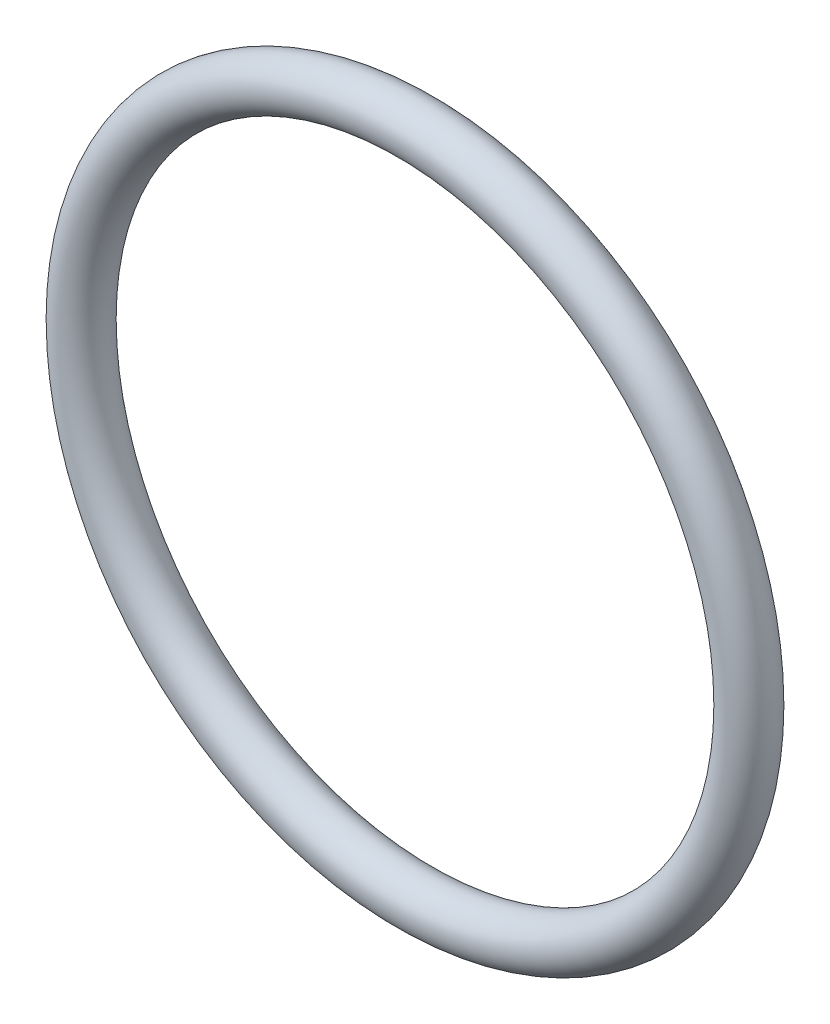
ISO-10303-21;
HEADER;
FILE_DESCRIPTION(('STEP AP214'),'2;1');
FILE_NAME('part.step','',(''),(''),'','','');
FILE_SCHEMA(('AUTOMOTIVE_DESIGN { 1 0 10303 214 1 1 1 1 }'));
ENDSEC;
DATA;
#1=APPLICATION_CONTEXT('core data for automotive mechanical design processes');
#2=APPLICATION_PROTOCOL_DEFINITION('international standard','automotive_design',2000,#1);
#3=PRODUCT_CONTEXT('',#1,'mechanical');
#4=PRODUCT('Part','Part','',(#3));
#5=PRODUCT_RELATED_PRODUCT_CATEGORY('part','',(#4));
#6=PRODUCT_DEFINITION_FORMATION('','',#4);
#7=PRODUCT_DEFINITION_CONTEXT('part definition',#1,'design');
#8=PRODUCT_DEFINITION('design','',#6,#7);
#9=PRODUCT_DEFINITION_SHAPE('','',#8);
#10=(LENGTH_UNIT() NAMED_UNIT(*) SI_UNIT(.MILLI.,.METRE.));
#11=(NAMED_UNIT(*) PLANE_ANGLE_UNIT() SI_UNIT($,.RADIAN.));
#12=(NAMED_UNIT(*) SI_UNIT($,.STERADIAN.) SOLID_ANGLE_UNIT());
#13=UNCERTAINTY_MEASURE_WITH_UNIT(LENGTH_MEASURE(1.E-05),#10,'distance_accuracy_value','');
#14=(GEOMETRIC_REPRESENTATION_CONTEXT(3) GLOBAL_UNCERTAINTY_ASSIGNED_CONTEXT((#13)) GLOBAL_UNIT_ASSIGNED_CONTEXT((#10,
#11,#12)) REPRESENTATION_CONTEXT('',''));
#15=CARTESIAN_POINT('',(0.,0.,0.));
#16=DIRECTION('',(0.,0.,1.));
#17=DIRECTION('',(1.,0.,0.));
#18=AXIS2_PLACEMENT_3D('',#15,#16,#17);
#19=CARTESIAN_POINT('',(0.,0.,0.));
#20=DIRECTION('',(0.,0.,1.));
#21=DIRECTION('',(1.,0.,0.));
#22=AXIS2_PLACEMENT_3D('',#19,#20,#21);
#23=TOROIDAL_SURFACE('',#22,23.7871,1.76530000000001);
#24=CARTESIAN_POINT('',(25.5524,0.,0.));
#25=VERTEX_POINT('',#24);
#26=VERTEX_LOOP('',#25);
#27=FACE_BOUND('',#26,.T.);
#28=ADVANCED_FACE('F30',(#27),#23,.T.);
#29=CLOSED_SHELL('',(#28));
#30=MANIFOLD_SOLID_BREP('B2',#29);
#31=ADVANCED_BREP_SHAPE_REPRESENTATION('',(#18,#30),#14);
#32=SHAPE_DEFINITION_REPRESENTATION(#9,#31);
ENDSEC;
END-ISO-10303-21;
